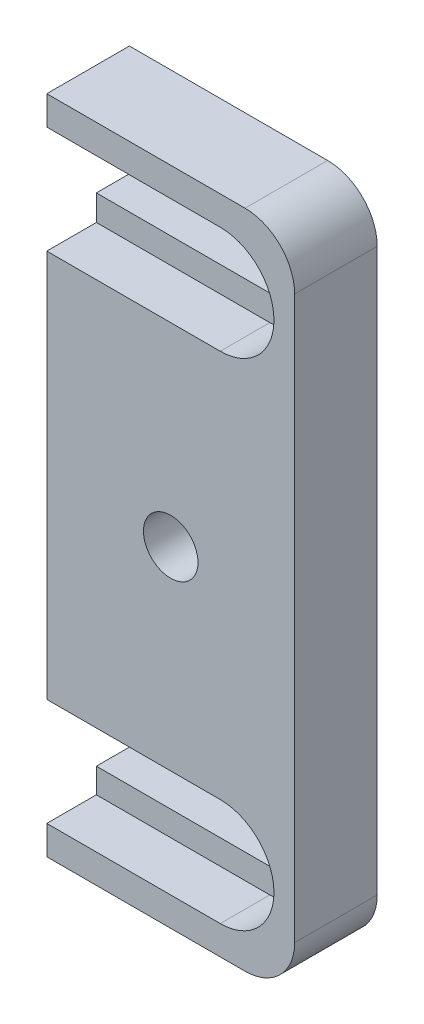
ISO-10303-21;
HEADER;
FILE_DESCRIPTION(('STEP AP214'),'2;1');
FILE_NAME('part.step','',(''),(''),'','','');
FILE_SCHEMA(('AUTOMOTIVE_DESIGN { 1 0 10303 214 1 1 1 1 }'));
ENDSEC;
DATA;
#1=APPLICATION_CONTEXT('core data for automotive mechanical design processes');
#2=APPLICATION_PROTOCOL_DEFINITION('international standard','automotive_design',2000,#1);
#3=PRODUCT_CONTEXT('',#1,'mechanical');
#4=PRODUCT('Part','Part','',(#3));
#5=PRODUCT_RELATED_PRODUCT_CATEGORY('part','',(#4));
#6=PRODUCT_DEFINITION_FORMATION('','',#4);
#7=PRODUCT_DEFINITION_CONTEXT('part definition',#1,'design');
#8=PRODUCT_DEFINITION('design','',#6,#7);
#9=PRODUCT_DEFINITION_SHAPE('','',#8);
#10=(LENGTH_UNIT() NAMED_UNIT(*) SI_UNIT(.MILLI.,.METRE.));
#11=(NAMED_UNIT(*) PLANE_ANGLE_UNIT() SI_UNIT($,.RADIAN.));
#12=(NAMED_UNIT(*) SI_UNIT($,.STERADIAN.) SOLID_ANGLE_UNIT());
#13=UNCERTAINTY_MEASURE_WITH_UNIT(LENGTH_MEASURE(1.E-05),#10,'distance_accuracy_value','');
#14=(GEOMETRIC_REPRESENTATION_CONTEXT(3) GLOBAL_UNCERTAINTY_ASSIGNED_CONTEXT((#13)) GLOBAL_UNIT_ASSIGNED_CONTEXT((#10,
#11,#12)) REPRESENTATION_CONTEXT('',''));
#15=CARTESIAN_POINT('',(0.,0.,0.));
#16=DIRECTION('',(0.,0.,1.));
#17=DIRECTION('',(1.,0.,0.));
#18=AXIS2_PLACEMENT_3D('',#15,#16,#17);
#19=CARTESIAN_POINT('',(0.,0.,0.));
#20=DIRECTION('',(-1.,0.,0.));
#21=DIRECTION('',(0.,-1.,0.));
#22=AXIS2_PLACEMENT_3D('',#19,#20,#21);
#23=PLANE('',#22);
#24=DIRECTION('',(0.,0.,-1.));
#25=VECTOR('',#24,1.);
#26=CARTESIAN_POINT('',(0.,-36.7500000000001,5.));
#27=LINE('',#26,#25);
#28=CARTESIAN_POINT('',(0.,-36.7500000000001,2.));
#29=VERTEX_POINT('',#28);
#30=CARTESIAN_POINT('',(0.,-36.7500000000001,0.));
#31=VERTEX_POINT('',#30);
#32=EDGE_CURVE('E183',#29,#31,#27,.T.);
#33=ORIENTED_EDGE('',*,*,#32,.T.);
#34=DIRECTION('',(0.,-1.,0.));
#35=VECTOR('',#34,1.);
#36=CARTESIAN_POINT('',(0.,0.,0.));
#37=LINE('',#36,#35);
#38=CARTESIAN_POINT('',(0.,-40.,0.));
#39=VERTEX_POINT('',#38);
#40=EDGE_CURVE('E196',#31,#39,#37,.T.);
#41=ORIENTED_EDGE('',*,*,#40,.T.);
#42=DIRECTION('',(0.,0.,1.));
#43=VECTOR('',#42,1.);
#44=CARTESIAN_POINT('',(0.,-40.,0.));
#45=LINE('',#44,#43);
#46=CARTESIAN_POINT('',(0.,-40.,5.));
#47=VERTEX_POINT('',#46);
#48=EDGE_CURVE('E225',#39,#47,#45,.T.);
#49=ORIENTED_EDGE('',*,*,#48,.T.);
#50=DIRECTION('',(0.,-1.,0.));
#51=VECTOR('',#50,1.);
#52=CARTESIAN_POINT('',(0.,0.,5.));
#53=LINE('',#52,#51);
#54=CARTESIAN_POINT('',(0.,-38.25,5.));
#55=VERTEX_POINT('',#54);
#56=EDGE_CURVE('E234',#55,#47,#53,.T.);
#57=ORIENTED_EDGE('',*,*,#56,.F.);
#58=DIRECTION('',(0.,0.,1.));
#59=VECTOR('',#58,1.);
#60=CARTESIAN_POINT('',(0.,-38.25,2.));
#61=LINE('',#60,#59);
#62=CARTESIAN_POINT('',(0.,-38.25,2.));
#63=VERTEX_POINT('',#62);
#64=EDGE_CURVE('E308',#63,#55,#61,.T.);
#65=ORIENTED_EDGE('',*,*,#64,.F.);
#66=DIRECTION('',(0.,-1.,0.));
#67=VECTOR('',#66,1.);
#68=CARTESIAN_POINT('',(0.,-31.7500000000001,2.));
#69=LINE('',#68,#67);
#70=EDGE_CURVE('E199',#29,#63,#69,.T.);
#71=ORIENTED_EDGE('',*,*,#70,.F.);
#72=EDGE_LOOP('',(#33,#41,#49,#57,#65,#71));
#73=FACE_BOUND('',#72,.T.);
#74=ADVANCED_FACE('F32',(#73),#23,.T.);
#75=DIRECTION('',(0.,0.,1.));
#76=VECTOR('',#75,1.);
#77=CARTESIAN_POINT('',(0.,-3.3,0.));
#78=LINE('',#77,#76);
#79=CARTESIAN_POINT('',(0.,-3.3,0.));
#80=VERTEX_POINT('',#79);
#81=CARTESIAN_POINT('',(0.,-3.3,2.));
#82=VERTEX_POINT('',#81);
#83=EDGE_CURVE('E320',#80,#82,#78,.T.);
#84=ORIENTED_EDGE('',*,*,#83,.T.);
#85=DIRECTION('',(0.,-1.,0.));
#86=VECTOR('',#85,1.);
#87=CARTESIAN_POINT('',(0.,-1.75,2.));
#88=LINE('',#87,#86);
#89=CARTESIAN_POINT('',(0.,-1.75,2.));
#90=VERTEX_POINT('',#89);
#91=EDGE_CURVE('E333',#90,#82,#88,.T.);
#92=ORIENTED_EDGE('',*,*,#91,.F.);
#93=DIRECTION('',(0.,0.,1.));
#94=VECTOR('',#93,1.);
#95=CARTESIAN_POINT('',(0.,-1.75,2.));
#96=LINE('',#95,#94);
#97=CARTESIAN_POINT('',(0.,-1.75,5.));
#98=VERTEX_POINT('',#97);
#99=EDGE_CURVE('E232',#90,#98,#96,.T.);
#100=ORIENTED_EDGE('',*,*,#99,.T.);
#101=CARTESIAN_POINT('',(0.,0.,5.));
#102=VERTEX_POINT('',#101);
#103=EDGE_CURVE('E235',#102,#98,#53,.T.);
#104=ORIENTED_EDGE('',*,*,#103,.F.);
#105=DIRECTION('',(0.,0.,1.));
#106=VECTOR('',#105,1.);
#107=CARTESIAN_POINT('',(0.,0.,0.));
#108=LINE('',#107,#106);
#109=CARTESIAN_POINT('',(0.,0.,0.));
#110=VERTEX_POINT('',#109);
#111=EDGE_CURVE('E220',#110,#102,#108,.T.);
#112=ORIENTED_EDGE('',*,*,#111,.F.);
#113=EDGE_CURVE('E210',#110,#80,#37,.T.);
#114=ORIENTED_EDGE('',*,*,#113,.T.);
#115=EDGE_LOOP('',(#84,#92,#100,#104,#112,#114));
#116=FACE_BOUND('',#115,.T.);
#117=ADVANCED_FACE('F365',(#116),#23,.T.);
#118=CARTESIAN_POINT('',(15.,-40.,0.));
#119=DIRECTION('',(1.,0.,0.));
#120=DIRECTION('',(0.,0.,-1.));
#121=AXIS2_PLACEMENT_3D('',#118,#119,#120);
#122=PLANE('',#121);
#123=DIRECTION('',(0.,1.,0.));
#124=VECTOR('',#123,1.);
#125=CARTESIAN_POINT('',(15.,-40.,5.));
#126=LINE('',#125,#124);
#127=CARTESIAN_POINT('',(15.,-37.,5.));
#128=VERTEX_POINT('',#127);
#129=CARTESIAN_POINT('',(15.,-3.,5.));
#130=VERTEX_POINT('',#129);
#131=EDGE_CURVE('E228',#128,#130,#126,.T.);
#132=ORIENTED_EDGE('',*,*,#131,.F.);
#133=DIRECTION('',(0.,0.,1.));
#134=VECTOR('',#133,1.);
#135=CARTESIAN_POINT('',(15.,-37.,0.));
#136=LINE('',#135,#134);
#137=CARTESIAN_POINT('',(15.,-37.,0.));
#138=VERTEX_POINT('',#137);
#139=EDGE_CURVE('E259',#128,#138,#136,.F.);
#140=ORIENTED_EDGE('',*,*,#139,.T.);
#141=DIRECTION('',(0.,1.,0.));
#142=VECTOR('',#141,1.);
#143=CARTESIAN_POINT('',(15.,-40.,0.));
#144=LINE('',#143,#142);
#145=CARTESIAN_POINT('',(15.,-3.,0.));
#146=VERTEX_POINT('',#145);
#147=EDGE_CURVE('E212',#138,#146,#144,.T.);
#148=ORIENTED_EDGE('',*,*,#147,.T.);
#149=DIRECTION('',(0.,0.,1.));
#150=VECTOR('',#149,1.);
#151=CARTESIAN_POINT('',(15.,-3.,0.));
#152=LINE('',#151,#150);
#153=EDGE_CURVE('E256',#146,#130,#152,.T.);
#154=ORIENTED_EDGE('',*,*,#153,.T.);
#155=EDGE_LOOP('',(#132,#140,#148,#154));
#156=FACE_BOUND('',#155,.T.);
#157=ADVANCED_FACE('F361',(#156),#122,.T.);
#158=CARTESIAN_POINT('',(0.,-40.,0.));
#159=DIRECTION('',(0.,-1.,0.));
#160=DIRECTION('',(1.,0.,0.));
#161=AXIS2_PLACEMENT_3D('',#158,#159,#160);
#162=PLANE('',#161);
#163=DIRECTION('',(1.,0.,0.));
#164=VECTOR('',#163,1.);
#165=CARTESIAN_POINT('',(0.,-40.,0.));
#166=LINE('',#165,#164);
#167=CARTESIAN_POINT('',(12.,-40.,0.));
#168=VERTEX_POINT('',#167);
#169=EDGE_CURVE('E206',#39,#168,#166,.T.);
#170=ORIENTED_EDGE('',*,*,#169,.T.);
#171=DIRECTION('',(0.,0.,1.));
#172=VECTOR('',#171,1.);
#173=CARTESIAN_POINT('',(12.,-40.,0.));
#174=LINE('',#173,#172);
#175=CARTESIAN_POINT('',(12.,-40.,5.));
#176=VERTEX_POINT('',#175);
#177=EDGE_CURVE('E250',#168,#176,#174,.T.);
#178=ORIENTED_EDGE('',*,*,#177,.T.);
#179=DIRECTION('',(1.,0.,0.));
#180=VECTOR('',#179,1.);
#181=CARTESIAN_POINT('',(0.,-40.,5.));
#182=LINE('',#181,#180);
#183=EDGE_CURVE('E238',#47,#176,#182,.T.);
#184=ORIENTED_EDGE('',*,*,#183,.F.);
#185=ORIENTED_EDGE('',*,*,#48,.F.);
#186=EDGE_LOOP('',(#170,#178,#184,#185));
#187=FACE_BOUND('',#186,.T.);
#188=ADVANCED_FACE('F266',(#187),#162,.T.);
#189=DIRECTION('',(0.,0.,-1.));
#190=VECTOR('',#189,1.);
#191=CARTESIAN_POINT('',(0.,-33.25,5.));
#192=LINE('',#191,#190);
#193=CARTESIAN_POINT('',(0.,-33.25,2.));
#194=VERTEX_POINT('',#193);
#195=CARTESIAN_POINT('',(0.,-33.25,0.));
#196=VERTEX_POINT('',#195);
#197=EDGE_CURVE('E200',#194,#196,#192,.T.);
#198=ORIENTED_EDGE('',*,*,#197,.F.);
#199=CARTESIAN_POINT('',(0.,-31.7500000000001,2.));
#200=VERTEX_POINT('',#199);
#201=EDGE_CURVE('E293',#200,#194,#69,.T.);
#202=ORIENTED_EDGE('',*,*,#201,.F.);
#203=DIRECTION('',(0.,0.,1.));
#204=VECTOR('',#203,1.);
#205=CARTESIAN_POINT('',(0.,-31.7500000000001,2.));
#206=LINE('',#205,#204);
#207=CARTESIAN_POINT('',(0.,-31.7500000000001,5.));
#208=VERTEX_POINT('',#207);
#209=EDGE_CURVE('E291',#200,#208,#206,.T.);
#210=ORIENTED_EDGE('',*,*,#209,.T.);
#211=CARTESIAN_POINT('',(0.,-8.25,5.));
#212=VERTEX_POINT('',#211);
#213=EDGE_CURVE('E239',#212,#208,#53,.T.);
#214=ORIENTED_EDGE('',*,*,#213,.F.);
#215=DIRECTION('',(0.,0.,1.));
#216=VECTOR('',#215,1.);
#217=CARTESIAN_POINT('',(0.,-8.25,2.));
#218=LINE('',#217,#216);
#219=CARTESIAN_POINT('',(0.,-8.25,2.));
#220=VERTEX_POINT('',#219);
#221=EDGE_CURVE('E289',#220,#212,#218,.T.);
#222=ORIENTED_EDGE('',*,*,#221,.F.);
#223=CARTESIAN_POINT('',(0.,-6.7,2.));
#224=VERTEX_POINT('',#223);
#225=EDGE_CURVE('E337',#224,#220,#88,.T.);
#226=ORIENTED_EDGE('',*,*,#225,.F.);
#227=DIRECTION('',(0.,0.,1.));
#228=VECTOR('',#227,1.);
#229=CARTESIAN_POINT('',(0.,-6.7,0.));
#230=LINE('',#229,#228);
#231=CARTESIAN_POINT('',(0.,-6.7,0.));
#232=VERTEX_POINT('',#231);
#233=EDGE_CURVE('E330',#232,#224,#230,.T.);
#234=ORIENTED_EDGE('',*,*,#233,.F.);
#235=EDGE_CURVE('E207',#232,#196,#37,.T.);
#236=ORIENTED_EDGE('',*,*,#235,.T.);
#237=EDGE_LOOP('',(#198,#202,#210,#214,#222,#226,#234,#236));
#238=FACE_BOUND('',#237,.T.);
#239=ADVANCED_FACE('F287',(#238),#23,.T.);
#240=CARTESIAN_POINT('',(15.,0.,0.));
#241=DIRECTION('',(0.,1.,0.));
#242=DIRECTION('',(0.,0.,1.));
#243=AXIS2_PLACEMENT_3D('',#240,#241,#242);
#244=PLANE('',#243);
#245=DIRECTION('',(-1.,0.,0.));
#246=VECTOR('',#245,1.);
#247=CARTESIAN_POINT('',(15.,0.,5.));
#248=LINE('',#247,#246);
#249=CARTESIAN_POINT('',(12.,0.,5.));
#250=VERTEX_POINT('',#249);
#251=EDGE_CURVE('E231',#250,#102,#248,.T.);
#252=ORIENTED_EDGE('',*,*,#251,.F.);
#253=DIRECTION('',(0.,0.,1.));
#254=VECTOR('',#253,1.);
#255=CARTESIAN_POINT('',(12.,0.,0.));
#256=LINE('',#255,#254);
#257=CARTESIAN_POINT('',(12.,0.,0.));
#258=VERTEX_POINT('',#257);
#259=EDGE_CURVE('E11',#250,#258,#256,.F.);
#260=ORIENTED_EDGE('',*,*,#259,.T.);
#261=DIRECTION('',(-1.,0.,0.));
#262=VECTOR('',#261,1.);
#263=CARTESIAN_POINT('',(15.,0.,0.));
#264=LINE('',#263,#262);
#265=EDGE_CURVE('E208',#258,#110,#264,.T.);
#266=ORIENTED_EDGE('',*,*,#265,.T.);
#267=ORIENTED_EDGE('',*,*,#111,.T.);
#268=EDGE_LOOP('',(#252,#260,#266,#267));
#269=FACE_BOUND('',#268,.T.);
#270=ADVANCED_FACE('F363',(#269),#244,.T.);
#271=CARTESIAN_POINT('',(0.,0.,0.));
#272=DIRECTION('',(0.,0.,1.));
#273=DIRECTION('',(1.,0.,0.));
#274=AXIS2_PLACEMENT_3D('',#271,#272,#273);
#275=PLANE('',#274);
#276=CARTESIAN_POINT('',(7.50000000000001,-20.,0.));
#277=DIRECTION('',(0.,0.,1.));
#278=DIRECTION('',(1.,0.,0.));
#279=AXIS2_PLACEMENT_3D('',#276,#277,#278);
#280=CIRCLE('',#279,1.65);
#281=CARTESIAN_POINT('',(9.15000000000001,-20.,0.));
#282=VERTEX_POINT('',#281);
#283=EDGE_CURVE('E191',#282,#282,#280,.T.);
#284=ORIENTED_EDGE('',*,*,#283,.T.);
#285=EDGE_LOOP('',(#284));
#286=FACE_BOUND('',#285,.T.);
#287=ORIENTED_EDGE('',*,*,#147,.F.);
#288=CARTESIAN_POINT('',(12.,-37.,0.));
#289=DIRECTION('',(0.,0.,1.));
#290=DIRECTION('',(1.,0.,0.));
#291=AXIS2_PLACEMENT_3D('',#288,#289,#290);
#292=CIRCLE('',#291,3.);
#293=EDGE_CURVE('E40',#138,#168,#292,.F.);
#294=ORIENTED_EDGE('',*,*,#293,.T.);
#295=ORIENTED_EDGE('',*,*,#169,.F.);
#296=ORIENTED_EDGE('',*,*,#40,.F.);
#297=DIRECTION('',(-1.,0.,0.));
#298=VECTOR('',#297,1.);
#299=CARTESIAN_POINT('',(10.5,-36.7500000000001,0.));
#300=LINE('',#299,#298);
#301=CARTESIAN_POINT('',(10.5,-36.7500000000001,0.));
#302=VERTEX_POINT('',#301);
#303=EDGE_CURVE('E180',#302,#31,#300,.T.);
#304=ORIENTED_EDGE('',*,*,#303,.F.);
#305=CARTESIAN_POINT('',(10.5,-35.,0.));
#306=DIRECTION('',(0.,0.,-1.));
#307=DIRECTION('',(-1.,0.,0.));
#308=AXIS2_PLACEMENT_3D('',#305,#306,#307);
#309=CIRCLE('',#308,1.75000000000003);
#310=CARTESIAN_POINT('',(10.5,-33.25,0.));
#311=VERTEX_POINT('',#310);
#312=EDGE_CURVE('E201',#311,#302,#309,.T.);
#313=ORIENTED_EDGE('',*,*,#312,.F.);
#314=DIRECTION('',(1.,0.,0.));
#315=VECTOR('',#314,1.);
#316=CARTESIAN_POINT('',(0.,-33.25,0.));
#317=LINE('',#316,#315);
#318=EDGE_CURVE('E190',#196,#311,#317,.T.);
#319=ORIENTED_EDGE('',*,*,#318,.F.);
#320=ORIENTED_EDGE('',*,*,#235,.F.);
#321=DIRECTION('',(1.,0.,0.));
#322=VECTOR('',#321,1.);
#323=CARTESIAN_POINT('',(0.,-6.7,0.));
#324=LINE('',#323,#322);
#325=CARTESIAN_POINT('',(10.5,-6.7,0.));
#326=VERTEX_POINT('',#325);
#327=EDGE_CURVE('E314',#232,#326,#324,.T.);
#328=ORIENTED_EDGE('',*,*,#327,.T.);
#329=CARTESIAN_POINT('',(10.5,-5.,0.));
#330=DIRECTION('',(0.,0.,1.));
#331=DIRECTION('',(1.,0.,0.));
#332=AXIS2_PLACEMENT_3D('',#329,#330,#331);
#333=CIRCLE('',#332,1.7);
#334=CARTESIAN_POINT('',(10.5,-3.30000000000001,0.));
#335=VERTEX_POINT('',#334);
#336=EDGE_CURVE('E318',#326,#335,#333,.T.);
#337=ORIENTED_EDGE('',*,*,#336,.T.);
#338=DIRECTION('',(-1.,0.,0.));
#339=VECTOR('',#338,1.);
#340=CARTESIAN_POINT('',(10.5,-3.3,0.));
#341=LINE('',#340,#339);
#342=EDGE_CURVE('E311',#335,#80,#341,.T.);
#343=ORIENTED_EDGE('',*,*,#342,.T.);
#344=ORIENTED_EDGE('',*,*,#113,.F.);
#345=ORIENTED_EDGE('',*,*,#265,.F.);
#346=CARTESIAN_POINT('',(12.,-3.,0.));
#347=DIRECTION('',(0.,0.,1.));
#348=DIRECTION('',(1.,0.,0.));
#349=AXIS2_PLACEMENT_3D('',#346,#347,#348);
#350=CIRCLE('',#349,3.);
#351=EDGE_CURVE('E52',#258,#146,#350,.F.);
#352=ORIENTED_EDGE('',*,*,#351,.T.);
#353=EDGE_LOOP('',(#287,#294,#295,#296,#304,#313,#319,#320,#328,#337,#343,#344,#345,#352));
#354=FACE_BOUND('',#353,.T.);
#355=ADVANCED_FACE('F204',(#286,#354),#275,.F.);
#356=CARTESIAN_POINT('',(0.,0.,5.));
#357=DIRECTION('',(0.,0.,1.));
#358=DIRECTION('',(1.,0.,0.));
#359=AXIS2_PLACEMENT_3D('',#356,#357,#358);
#360=PLANE('',#359);
#361=CARTESIAN_POINT('',(7.50000000000001,-20.,5.));
#362=DIRECTION('',(0.,0.,1.));
#363=DIRECTION('',(1.,0.,0.));
#364=AXIS2_PLACEMENT_3D('',#361,#362,#363);
#365=CIRCLE('',#364,1.65);
#366=CARTESIAN_POINT('',(9.15000000000001,-20.,5.));
#367=VERTEX_POINT('',#366);
#368=EDGE_CURVE('E492',#367,#367,#365,.T.);
#369=ORIENTED_EDGE('',*,*,#368,.F.);
#370=EDGE_LOOP('',(#369));
#371=FACE_BOUND('',#370,.T.);
#372=ORIENTED_EDGE('',*,*,#183,.T.);
#373=CARTESIAN_POINT('',(12.,-37.,5.));
#374=DIRECTION('',(0.,0.,1.));
#375=DIRECTION('',(1.,0.,0.));
#376=AXIS2_PLACEMENT_3D('',#373,#374,#375);
#377=CIRCLE('',#376,3.);
#378=EDGE_CURVE('E254',#176,#128,#377,.T.);
#379=ORIENTED_EDGE('',*,*,#378,.T.);
#380=ORIENTED_EDGE('',*,*,#131,.T.);
#381=CARTESIAN_POINT('',(12.,-3.,5.));
#382=DIRECTION('',(0.,0.,1.));
#383=DIRECTION('',(1.,0.,0.));
#384=AXIS2_PLACEMENT_3D('',#381,#382,#383);
#385=CIRCLE('',#384,3.);
#386=EDGE_CURVE('E252',#130,#250,#385,.T.);
#387=ORIENTED_EDGE('',*,*,#386,.T.);
#388=ORIENTED_EDGE('',*,*,#251,.T.);
#389=ORIENTED_EDGE('',*,*,#103,.T.);
#390=DIRECTION('',(-1.,0.,0.));
#391=VECTOR('',#390,1.);
#392=CARTESIAN_POINT('',(10.5,-1.75,5.));
#393=LINE('',#392,#391);
#394=CARTESIAN_POINT('',(10.5,-1.75000000000001,5.));
#395=VERTEX_POINT('',#394);
#396=EDGE_CURVE('E350',#395,#98,#393,.T.);
#397=ORIENTED_EDGE('',*,*,#396,.F.);
#398=CARTESIAN_POINT('',(10.5,-5.,5.));
#399=DIRECTION('',(0.,0.,1.));
#400=DIRECTION('',(1.,0.,0.));
#401=AXIS2_PLACEMENT_3D('',#398,#399,#400);
#402=CIRCLE('',#401,3.25);
#403=CARTESIAN_POINT('',(10.5,-8.25,5.));
#404=VERTEX_POINT('',#403);
#405=EDGE_CURVE('E347',#404,#395,#402,.T.);
#406=ORIENTED_EDGE('',*,*,#405,.F.);
#407=DIRECTION('',(1.,0.,0.));
#408=VECTOR('',#407,1.);
#409=CARTESIAN_POINT('',(0.,-8.25,5.));
#410=LINE('',#409,#408);
#411=EDGE_CURVE('E282',#212,#404,#410,.T.);
#412=ORIENTED_EDGE('',*,*,#411,.F.);
#413=ORIENTED_EDGE('',*,*,#213,.T.);
#414=DIRECTION('',(-1.,0.,0.));
#415=VECTOR('',#414,1.);
#416=CARTESIAN_POINT('',(10.5,-31.7500000000001,5.));
#417=LINE('',#416,#415);
#418=CARTESIAN_POINT('',(10.5,-31.7500000000001,5.));
#419=VERTEX_POINT('',#418);
#420=EDGE_CURVE('E279',#419,#208,#417,.T.);
#421=ORIENTED_EDGE('',*,*,#420,.F.);
#422=CARTESIAN_POINT('',(10.5,-35.,5.));
#423=DIRECTION('',(0.,0.,1.));
#424=DIRECTION('',(1.,0.,0.));
#425=AXIS2_PLACEMENT_3D('',#422,#423,#424);
#426=CIRCLE('',#425,3.24999999999998);
#427=CARTESIAN_POINT('',(10.5,-38.25,5.));
#428=VERTEX_POINT('',#427);
#429=EDGE_CURVE('E404',#428,#419,#426,.T.);
#430=ORIENTED_EDGE('',*,*,#429,.F.);
#431=DIRECTION('',(1.,0.,0.));
#432=VECTOR('',#431,1.);
#433=CARTESIAN_POINT('',(0.,-38.25,5.));
#434=LINE('',#433,#432);
#435=EDGE_CURVE('E274',#55,#428,#434,.T.);
#436=ORIENTED_EDGE('',*,*,#435,.F.);
#437=ORIENTED_EDGE('',*,*,#56,.T.);
#438=EDGE_LOOP('',(#372,#379,#380,#387,#388,#389,#397,#406,#412,#413,#421,#430,#436,#437));
#439=FACE_BOUND('',#438,.T.);
#440=ADVANCED_FACE('F268',(#371,#439),#360,.T.);
#441=CARTESIAN_POINT('',(10.5,-1.75,2.));
#442=DIRECTION('',(0.,1.,0.));
#443=DIRECTION('',(-1.,0.,0.));
#444=AXIS2_PLACEMENT_3D('',#441,#442,#443);
#445=PLANE('',#444);
#446=ORIENTED_EDGE('',*,*,#396,.T.);
#447=ORIENTED_EDGE('',*,*,#99,.F.);
#448=DIRECTION('',(-1.,0.,0.));
#449=VECTOR('',#448,1.);
#450=CARTESIAN_POINT('',(10.5,-1.75,2.));
#451=LINE('',#450,#449);
#452=CARTESIAN_POINT('',(10.5,-1.75000000000001,2.));
#453=VERTEX_POINT('',#452);
#454=EDGE_CURVE('E343',#453,#90,#451,.T.);
#455=ORIENTED_EDGE('',*,*,#454,.F.);
#456=DIRECTION('',(0.,0.,1.));
#457=VECTOR('',#456,1.);
#458=CARTESIAN_POINT('',(10.5,-1.75000000000001,2.));
#459=LINE('',#458,#457);
#460=EDGE_CURVE('E354',#453,#395,#459,.T.);
#461=ORIENTED_EDGE('',*,*,#460,.T.);
#462=EDGE_LOOP('',(#446,#447,#455,#461));
#463=FACE_BOUND('',#462,.T.);
#464=ADVANCED_FACE('F369',(#463),#445,.F.);
#465=CARTESIAN_POINT('',(10.5,-5.,2.));
#466=DIRECTION('',(0.,0.,1.));
#467=DIRECTION('',(1.,0.,0.));
#468=AXIS2_PLACEMENT_3D('',#465,#466,#467);
#469=CYLINDRICAL_SURFACE('',#468,3.25);
#470=ORIENTED_EDGE('',*,*,#405,.T.);
#471=ORIENTED_EDGE('',*,*,#460,.F.);
#472=CARTESIAN_POINT('',(10.5,-5.,2.));
#473=DIRECTION('',(0.,0.,1.));
#474=DIRECTION('',(1.,0.,0.));
#475=AXIS2_PLACEMENT_3D('',#472,#473,#474);
#476=CIRCLE('',#475,3.25);
#477=CARTESIAN_POINT('',(10.5,-8.25,2.));
#478=VERTEX_POINT('',#477);
#479=EDGE_CURVE('E340',#478,#453,#476,.T.);
#480=ORIENTED_EDGE('',*,*,#479,.F.);
#481=DIRECTION('',(0.,0.,1.));
#482=VECTOR('',#481,1.);
#483=CARTESIAN_POINT('',(10.5,-8.25,2.));
#484=LINE('',#483,#482);
#485=EDGE_CURVE('E356',#478,#404,#484,.T.);
#486=ORIENTED_EDGE('',*,*,#485,.T.);
#487=EDGE_LOOP('',(#470,#471,#480,#486));
#488=FACE_BOUND('',#487,.T.);
#489=ADVANCED_FACE('F373',(#488),#469,.F.);
#490=CARTESIAN_POINT('',(0.,-8.25,2.));
#491=DIRECTION('',(0.,-1.,0.));
#492=DIRECTION('',(0.,0.,-1.));
#493=AXIS2_PLACEMENT_3D('',#490,#491,#492);
#494=PLANE('',#493);
#495=ORIENTED_EDGE('',*,*,#411,.T.);
#496=ORIENTED_EDGE('',*,*,#485,.F.);
#497=DIRECTION('',(1.,0.,0.));
#498=VECTOR('',#497,1.);
#499=CARTESIAN_POINT('',(0.,-8.25,2.));
#500=LINE('',#499,#498);
#501=EDGE_CURVE('E336',#220,#478,#500,.T.);
#502=ORIENTED_EDGE('',*,*,#501,.F.);
#503=ORIENTED_EDGE('',*,*,#221,.T.);
#504=EDGE_LOOP('',(#495,#496,#502,#503));
#505=FACE_BOUND('',#504,.T.);
#506=ADVANCED_FACE('F376',(#505),#494,.F.);
#507=CARTESIAN_POINT('',(10.5,-5.,2.));
#508=DIRECTION('',(0.,0.,1.));
#509=DIRECTION('',(1.,0.,0.));
#510=AXIS2_PLACEMENT_3D('',#507,#508,#509);
#511=PLANE('',#510);
#512=DIRECTION('',(-1.,0.,0.));
#513=VECTOR('',#512,1.);
#514=CARTESIAN_POINT('',(10.5,-3.3,2.));
#515=LINE('',#514,#513);
#516=CARTESIAN_POINT('',(10.5,-3.30000000000001,2.));
#517=VERTEX_POINT('',#516);
#518=EDGE_CURVE('E297',#517,#82,#515,.T.);
#519=ORIENTED_EDGE('',*,*,#518,.F.);
#520=CARTESIAN_POINT('',(10.5,-5.,2.));
#521=DIRECTION('',(0.,0.,1.));
#522=DIRECTION('',(1.,0.,0.));
#523=AXIS2_PLACEMENT_3D('',#520,#521,#522);
#524=CIRCLE('',#523,1.7);
#525=CARTESIAN_POINT('',(10.5,-6.7,2.));
#526=VERTEX_POINT('',#525);
#527=EDGE_CURVE('E315',#526,#517,#524,.T.);
#528=ORIENTED_EDGE('',*,*,#527,.F.);
#529=DIRECTION('',(1.,0.,0.));
#530=VECTOR('',#529,1.);
#531=CARTESIAN_POINT('',(0.,-6.7,2.));
#532=LINE('',#531,#530);
#533=EDGE_CURVE('E300',#224,#526,#532,.T.);
#534=ORIENTED_EDGE('',*,*,#533,.F.);
#535=ORIENTED_EDGE('',*,*,#225,.T.);
#536=ORIENTED_EDGE('',*,*,#501,.T.);
#537=ORIENTED_EDGE('',*,*,#479,.T.);
#538=ORIENTED_EDGE('',*,*,#454,.T.);
#539=ORIENTED_EDGE('',*,*,#91,.T.);
#540=EDGE_LOOP('',(#519,#528,#534,#535,#536,#537,#538,#539));
#541=FACE_BOUND('',#540,.T.);
#542=ADVANCED_FACE('F379',(#541),#511,.T.);
#543=CARTESIAN_POINT('',(10.5,-3.3,0.));
#544=DIRECTION('',(0.,1.,0.));
#545=DIRECTION('',(-1.,0.,0.));
#546=AXIS2_PLACEMENT_3D('',#543,#544,#545);
#547=PLANE('',#546);
#548=ORIENTED_EDGE('',*,*,#518,.T.);
#549=ORIENTED_EDGE('',*,*,#83,.F.);
#550=ORIENTED_EDGE('',*,*,#342,.F.);
#551=DIRECTION('',(0.,0.,1.));
#552=VECTOR('',#551,1.);
#553=CARTESIAN_POINT('',(10.5,-3.30000000000001,0.));
#554=LINE('',#553,#552);
#555=EDGE_CURVE('E326',#335,#517,#554,.T.);
#556=ORIENTED_EDGE('',*,*,#555,.T.);
#557=EDGE_LOOP('',(#548,#549,#550,#556));
#558=FACE_BOUND('',#557,.T.);
#559=ADVANCED_FACE('F458',(#558),#547,.F.);
#560=CARTESIAN_POINT('',(10.5,-5.,0.));
#561=DIRECTION('',(0.,0.,1.));
#562=DIRECTION('',(1.,0.,0.));
#563=AXIS2_PLACEMENT_3D('',#560,#561,#562);
#564=CYLINDRICAL_SURFACE('',#563,1.7);
#565=ORIENTED_EDGE('',*,*,#527,.T.);
#566=ORIENTED_EDGE('',*,*,#555,.F.);
#567=ORIENTED_EDGE('',*,*,#336,.F.);
#568=DIRECTION('',(0.,0.,1.));
#569=VECTOR('',#568,1.);
#570=CARTESIAN_POINT('',(10.5,-6.7,0.));
#571=LINE('',#570,#569);
#572=EDGE_CURVE('E328',#326,#526,#571,.T.);
#573=ORIENTED_EDGE('',*,*,#572,.T.);
#574=EDGE_LOOP('',(#565,#566,#567,#573));
#575=FACE_BOUND('',#574,.T.);
#576=ADVANCED_FACE('F424',(#575),#564,.F.);
#577=CARTESIAN_POINT('',(0.,-6.7,0.));
#578=DIRECTION('',(0.,-1.,0.));
#579=DIRECTION('',(1.,0.,0.));
#580=AXIS2_PLACEMENT_3D('',#577,#578,#579);
#581=PLANE('',#580);
#582=ORIENTED_EDGE('',*,*,#533,.T.);
#583=ORIENTED_EDGE('',*,*,#572,.F.);
#584=ORIENTED_EDGE('',*,*,#327,.F.);
#585=ORIENTED_EDGE('',*,*,#233,.T.);
#586=EDGE_LOOP('',(#582,#583,#584,#585));
#587=FACE_BOUND('',#586,.T.);
#588=ADVANCED_FACE('F417',(#587),#581,.F.);
#589=CARTESIAN_POINT('',(10.5,-31.7500000000001,2.));
#590=DIRECTION('',(0.,1.,0.));
#591=DIRECTION('',(0.,0.,1.));
#592=AXIS2_PLACEMENT_3D('',#589,#590,#591);
#593=PLANE('',#592);
#594=ORIENTED_EDGE('',*,*,#420,.T.);
#595=ORIENTED_EDGE('',*,*,#209,.F.);
#596=DIRECTION('',(-1.,0.,0.));
#597=VECTOR('',#596,1.);
#598=CARTESIAN_POINT('',(10.5,-31.7500000000001,2.));
#599=LINE('',#598,#597);
#600=CARTESIAN_POINT('',(10.5,-31.7500000000001,2.));
#601=VERTEX_POINT('',#600);
#602=EDGE_CURVE('E310',#601,#200,#599,.T.);
#603=ORIENTED_EDGE('',*,*,#602,.F.);
#604=DIRECTION('',(0.,0.,1.));
#605=VECTOR('',#604,1.);
#606=CARTESIAN_POINT('',(10.5,-31.7500000000001,2.));
#607=LINE('',#606,#605);
#608=EDGE_CURVE('E298',#601,#419,#607,.T.);
#609=ORIENTED_EDGE('',*,*,#608,.T.);
#610=EDGE_LOOP('',(#594,#595,#603,#609));
#611=FACE_BOUND('',#610,.T.);
#612=ADVANCED_FACE('F415',(#611),#593,.F.);
#613=CARTESIAN_POINT('',(10.5,-35.,2.));
#614=DIRECTION('',(0.,0.,1.));
#615=DIRECTION('',(1.,0.,0.));
#616=AXIS2_PLACEMENT_3D('',#613,#614,#615);
#617=CYLINDRICAL_SURFACE('',#616,3.24999999999998);
#618=ORIENTED_EDGE('',*,*,#429,.T.);
#619=ORIENTED_EDGE('',*,*,#608,.F.);
#620=CARTESIAN_POINT('',(10.5,-35.,2.));
#621=DIRECTION('',(0.,0.,1.));
#622=DIRECTION('',(1.,0.,0.));
#623=AXIS2_PLACEMENT_3D('',#620,#621,#622);
#624=CIRCLE('',#623,3.24999999999998);
#625=CARTESIAN_POINT('',(10.5,-38.25,2.));
#626=VERTEX_POINT('',#625);
#627=EDGE_CURVE('E400',#626,#601,#624,.T.);
#628=ORIENTED_EDGE('',*,*,#627,.F.);
#629=DIRECTION('',(0.,0.,1.));
#630=VECTOR('',#629,1.);
#631=CARTESIAN_POINT('',(10.5,-38.25,2.));
#632=LINE('',#631,#630);
#633=EDGE_CURVE('E302',#626,#428,#632,.T.);
#634=ORIENTED_EDGE('',*,*,#633,.T.);
#635=EDGE_LOOP('',(#618,#619,#628,#634));
#636=FACE_BOUND('',#635,.T.);
#637=ADVANCED_FACE('F414',(#636),#617,.F.);
#638=CARTESIAN_POINT('',(0.,-38.25,2.));
#639=DIRECTION('',(0.,-1.,0.));
#640=DIRECTION('',(0.,0.,-1.));
#641=AXIS2_PLACEMENT_3D('',#638,#639,#640);
#642=PLANE('',#641);
#643=ORIENTED_EDGE('',*,*,#435,.T.);
#644=ORIENTED_EDGE('',*,*,#633,.F.);
#645=DIRECTION('',(1.,0.,0.));
#646=VECTOR('',#645,1.);
#647=CARTESIAN_POINT('',(0.,-38.25,2.));
#648=LINE('',#647,#646);
#649=EDGE_CURVE('E397',#63,#626,#648,.T.);
#650=ORIENTED_EDGE('',*,*,#649,.F.);
#651=ORIENTED_EDGE('',*,*,#64,.T.);
#652=EDGE_LOOP('',(#643,#644,#650,#651));
#653=FACE_BOUND('',#652,.T.);
#654=ADVANCED_FACE('F412',(#653),#642,.F.);
#655=CARTESIAN_POINT('',(10.5,-35.,2.));
#656=DIRECTION('',(0.,0.,1.));
#657=DIRECTION('',(1.,0.,0.));
#658=AXIS2_PLACEMENT_3D('',#655,#656,#657);
#659=PLANE('',#658);
#660=DIRECTION('',(1.,0.,0.));
#661=VECTOR('',#660,1.);
#662=CARTESIAN_POINT('',(10.5,-36.7500000000001,2.));
#663=LINE('',#662,#661);
#664=CARTESIAN_POINT('',(10.5,-36.7500000000001,2.));
#665=VERTEX_POINT('',#664);
#666=EDGE_CURVE('E248',#29,#665,#663,.T.);
#667=ORIENTED_EDGE('',*,*,#666,.F.);
#668=ORIENTED_EDGE('',*,*,#70,.T.);
#669=ORIENTED_EDGE('',*,*,#649,.T.);
#670=ORIENTED_EDGE('',*,*,#627,.T.);
#671=ORIENTED_EDGE('',*,*,#602,.T.);
#672=ORIENTED_EDGE('',*,*,#201,.T.);
#673=DIRECTION('',(-1.,0.,0.));
#674=VECTOR('',#673,1.);
#675=CARTESIAN_POINT('',(10.5,-33.25,2.));
#676=LINE('',#675,#674);
#677=CARTESIAN_POINT('',(10.5,-33.25,2.));
#678=VERTEX_POINT('',#677);
#679=EDGE_CURVE('E242',#678,#194,#676,.T.);
#680=ORIENTED_EDGE('',*,*,#679,.F.);
#681=CARTESIAN_POINT('',(10.5,-35.,2.));
#682=DIRECTION('',(0.,0.,1.));
#683=DIRECTION('',(1.,0.,0.));
#684=AXIS2_PLACEMENT_3D('',#681,#682,#683);
#685=CIRCLE('',#684,1.75000000000003);
#686=EDGE_CURVE('E245',#665,#678,#685,.T.);
#687=ORIENTED_EDGE('',*,*,#686,.F.);
#688=EDGE_LOOP('',(#667,#668,#669,#670,#671,#672,#680,#687));
#689=FACE_BOUND('',#688,.T.);
#690=ADVANCED_FACE('F409',(#689),#659,.T.);
#691=CARTESIAN_POINT('',(10.5,-36.7500000000001,5.));
#692=DIRECTION('',(0.,-1.,0.));
#693=DIRECTION('',(0.,0.,-1.));
#694=AXIS2_PLACEMENT_3D('',#691,#692,#693);
#695=PLANE('',#694);
#696=ORIENTED_EDGE('',*,*,#666,.T.);
#697=DIRECTION('',(0.,0.,-1.));
#698=VECTOR('',#697,1.);
#699=CARTESIAN_POINT('',(10.5,-36.7500000000001,5.));
#700=LINE('',#699,#698);
#701=EDGE_CURVE('E186',#665,#302,#700,.T.);
#702=ORIENTED_EDGE('',*,*,#701,.T.);
#703=ORIENTED_EDGE('',*,*,#303,.T.);
#704=ORIENTED_EDGE('',*,*,#32,.F.);
#705=EDGE_LOOP('',(#696,#702,#703,#704));
#706=FACE_BOUND('',#705,.T.);
#707=ADVANCED_FACE('F182',(#706),#695,.F.);
#708=CARTESIAN_POINT('',(10.5,-35.,5.));
#709=DIRECTION('',(0.,0.,-1.));
#710=DIRECTION('',(-1.,0.,0.));
#711=AXIS2_PLACEMENT_3D('',#708,#709,#710);
#712=CYLINDRICAL_SURFACE('',#711,1.75000000000003);
#713=ORIENTED_EDGE('',*,*,#686,.T.);
#714=DIRECTION('',(0.,0.,-1.));
#715=VECTOR('',#714,1.);
#716=CARTESIAN_POINT('',(10.5,-33.25,5.));
#717=LINE('',#716,#715);
#718=EDGE_CURVE('E393',#678,#311,#717,.T.);
#719=ORIENTED_EDGE('',*,*,#718,.T.);
#720=ORIENTED_EDGE('',*,*,#312,.T.);
#721=ORIENTED_EDGE('',*,*,#701,.F.);
#722=EDGE_LOOP('',(#713,#719,#720,#721));
#723=FACE_BOUND('',#722,.T.);
#724=ADVANCED_FACE('F472',(#723),#712,.F.);
#725=CARTESIAN_POINT('',(0.,-33.25,5.));
#726=DIRECTION('',(0.,1.,0.));
#727=DIRECTION('',(0.,0.,1.));
#728=AXIS2_PLACEMENT_3D('',#725,#726,#727);
#729=PLANE('',#728);
#730=ORIENTED_EDGE('',*,*,#679,.T.);
#731=ORIENTED_EDGE('',*,*,#197,.T.);
#732=ORIENTED_EDGE('',*,*,#318,.T.);
#733=ORIENTED_EDGE('',*,*,#718,.F.);
#734=EDGE_LOOP('',(#730,#731,#732,#733));
#735=FACE_BOUND('',#734,.T.);
#736=ADVANCED_FACE('F475',(#735),#729,.F.);
#737=CARTESIAN_POINT('',(7.50000000000001,-20.,5.));
#738=DIRECTION('',(0.,0.,1.));
#739=DIRECTION('',(1.,0.,0.));
#740=AXIS2_PLACEMENT_3D('',#737,#738,#739);
#741=CYLINDRICAL_SURFACE('',#740,1.65);
#742=ORIENTED_EDGE('',*,*,#283,.F.);
#743=EDGE_LOOP('',(#742));
#744=FACE_BOUND('',#743,.T.);
#745=ORIENTED_EDGE('',*,*,#368,.T.);
#746=EDGE_LOOP('',(#745));
#747=FACE_BOUND('',#746,.T.);
#748=ADVANCED_FACE('F478',(#744,#747),#741,.F.);
#749=CARTESIAN_POINT('',(12.,-37.,0.));
#750=DIRECTION('',(0.,0.,1.));
#751=DIRECTION('',(1.,0.,0.));
#752=AXIS2_PLACEMENT_3D('',#749,#750,#751);
#753=CYLINDRICAL_SURFACE('',#752,3.);
#754=ORIENTED_EDGE('',*,*,#293,.F.);
#755=ORIENTED_EDGE('',*,*,#139,.F.);
#756=ORIENTED_EDGE('',*,*,#378,.F.);
#757=ORIENTED_EDGE('',*,*,#177,.F.);
#758=EDGE_LOOP('',(#754,#755,#756,#757));
#759=FACE_BOUND('',#758,.T.);
#760=ADVANCED_FACE('F264',(#759),#753,.T.);
#761=CARTESIAN_POINT('',(12.,-3.,0.));
#762=DIRECTION('',(0.,0.,1.));
#763=DIRECTION('',(1.,0.,0.));
#764=AXIS2_PLACEMENT_3D('',#761,#762,#763);
#765=CYLINDRICAL_SURFACE('',#764,3.);
#766=ORIENTED_EDGE('',*,*,#351,.F.);
#767=ORIENTED_EDGE('',*,*,#259,.F.);
#768=ORIENTED_EDGE('',*,*,#386,.F.);
#769=ORIENTED_EDGE('',*,*,#153,.F.);
#770=EDGE_LOOP('',(#766,#767,#768,#769));
#771=FACE_BOUND('',#770,.T.);
#772=ADVANCED_FACE('F34',(#771),#765,.T.);
#773=CLOSED_SHELL('',(#74,#117,#157,#188,#239,#270,#355,#440,#464,#489,#506,#542,#559,#576,#588,
#612,#637,#654,#690,#707,#724,#736,#748,#760,#772));
#774=MANIFOLD_SOLID_BREP('B2',#773);
#775=ADVANCED_BREP_SHAPE_REPRESENTATION('',(#18,#774),#14);
#776=SHAPE_DEFINITION_REPRESENTATION(#9,#775);
ENDSEC;
END-ISO-10303-21;
